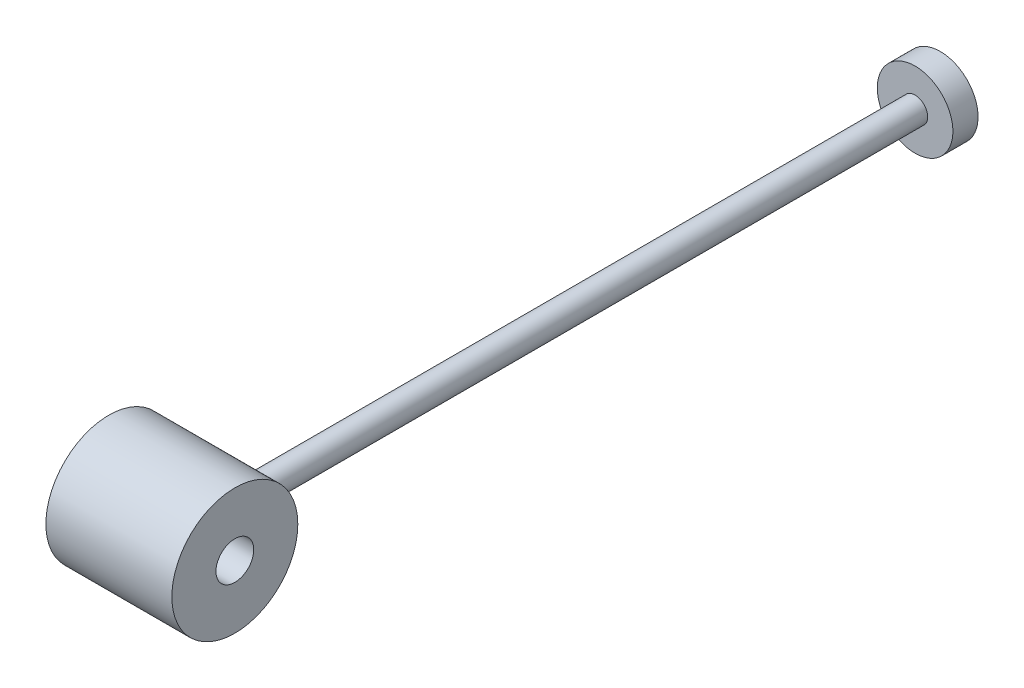
ISO-10303-21;
HEADER;
FILE_DESCRIPTION(('STEP AP214'),'2;1');
FILE_NAME('part.step','',(''),(''),'','','');
FILE_SCHEMA(('AUTOMOTIVE_DESIGN { 1 0 10303 214 1 1 1 1 }'));
ENDSEC;
DATA;
#1=APPLICATION_CONTEXT('core data for automotive mechanical design processes');
#2=APPLICATION_PROTOCOL_DEFINITION('international standard','automotive_design',2000,#1);
#3=PRODUCT_CONTEXT('',#1,'mechanical');
#4=PRODUCT('Part','Part','',(#3));
#5=PRODUCT_RELATED_PRODUCT_CATEGORY('part','',(#4));
#6=PRODUCT_DEFINITION_FORMATION('','',#4);
#7=PRODUCT_DEFINITION_CONTEXT('part definition',#1,'design');
#8=PRODUCT_DEFINITION('design','',#6,#7);
#9=PRODUCT_DEFINITION_SHAPE('','',#8);
#10=(LENGTH_UNIT() NAMED_UNIT(*) SI_UNIT(.MILLI.,.METRE.));
#11=(NAMED_UNIT(*) PLANE_ANGLE_UNIT() SI_UNIT($,.RADIAN.));
#12=(NAMED_UNIT(*) SI_UNIT($,.STERADIAN.) SOLID_ANGLE_UNIT());
#13=UNCERTAINTY_MEASURE_WITH_UNIT(LENGTH_MEASURE(1.E-05),#10,'distance_accuracy_value','');
#14=(GEOMETRIC_REPRESENTATION_CONTEXT(3) GLOBAL_UNCERTAINTY_ASSIGNED_CONTEXT((#13)) GLOBAL_UNIT_ASSIGNED_CONTEXT((#10,
#11,#12)) REPRESENTATION_CONTEXT('',''));
#15=CARTESIAN_POINT('',(0.,0.,0.));
#16=DIRECTION('',(0.,0.,1.));
#17=DIRECTION('',(1.,0.,0.));
#18=AXIS2_PLACEMENT_3D('',#15,#16,#17);
#19=CARTESIAN_POINT('',(0.,0.,-300.));
#20=DIRECTION('',(0.,0.,1.));
#21=DIRECTION('',(1.,0.,0.));
#22=AXIS2_PLACEMENT_3D('',#19,#20,#21);
#23=CYLINDRICAL_SURFACE('',#22,5.);
#24=CARTESIAN_POINT('',(5.,0.,-25.));
#25=CARTESIAN_POINT('',(5.00000276944634,0.138987493787324,-25.0000014065203));
#26=CARTESIAN_POINT('',(4.99420324928108,0.277940302046087,-24.9988389427216));
#27=CARTESIAN_POINT('',(4.97105635129736,0.554886864496204,-24.994224565157));
#28=CARTESIAN_POINT('',(4.95370679489748,0.692880432791918,-24.9907722194715));
#29=CARTESIAN_POINT('',(4.90758143771224,0.966937148503879,-24.981670242636));
#30=CARTESIAN_POINT('',(4.87879984551409,1.10299928122357,-24.9760194978176));
#31=CARTESIAN_POINT('',(4.81002534910899,1.37221108352448,-24.9626762565998));
#32=CARTESIAN_POINT('',(4.7700283237777,1.50535966309261,-24.9549830097359));
#33=CARTESIAN_POINT('',(4.67919625225816,1.76758319373794,-24.9377804442932));
#34=CARTESIAN_POINT('',(4.6283758297848,1.896663374225,-24.9282735779222));
#35=CARTESIAN_POINT('',(4.51622401781226,2.15009997814348,-24.9076944208426));
#36=CARTESIAN_POINT('',(4.45488875234116,2.2744546389337,-24.8966215531404));
#37=CARTESIAN_POINT('',(4.32219456929056,2.51749782000809,-24.8732206370355));
#38=CARTESIAN_POINT('',(4.25084014170608,2.63618884664851,-24.8608931515555));
#39=CARTESIAN_POINT('',(4.09856036475226,2.86722020463685,-24.8353088041128));
#40=CARTESIAN_POINT('',(4.01763144246466,2.97955814193968,-24.8220515959613));
#41=CARTESIAN_POINT('',(3.84577119317021,3.1983785388143,-24.7948114657324));
#42=CARTESIAN_POINT('',(3.75473335664577,3.30477652475172,-24.780821838943));
#43=CARTESIAN_POINT('',(3.56403766796452,3.50958996762925,-24.7526457290753));
#44=CARTESIAN_POINT('',(3.46437663408191,3.60800245195942,-24.738459174971));
#45=CARTESIAN_POINT('',(3.25716556407394,3.79610927604841,-24.7102933832022));
#46=CARTESIAN_POINT('',(3.1496178112366,3.88580612172819,-24.6963140869323));
#47=CARTESIAN_POINT('',(2.92729283454244,4.05592901668139,-24.6689453876667));
#48=CARTESIAN_POINT('',(2.81251295883554,4.13635163435981,-24.6555562041458));
#49=CARTESIAN_POINT('',(2.57548415685045,4.28798741229219,-24.6296394657581));
#50=CARTESIAN_POINT('',(2.4531786550123,4.35911381454494,-24.6171204770982));
#51=CARTESIAN_POINT('',(2.20287125287649,4.49081269831453,-24.5934353082732));
#52=CARTESIAN_POINT('',(2.07486723801243,4.55138122040544,-24.5822696361062));
#53=CARTESIAN_POINT('',(1.6837416438572,4.71644727257975,-24.5513304070068));
#54=CARTESIAN_POINT('',(1.41321932460559,4.80448882604819,-24.5340820165953));
#55=CARTESIAN_POINT('',(0.864538565206144,4.9326478026569,-24.508635793463));
#56=CARTESIAN_POINT('',(0.586526670293086,4.97337819482264,-24.5003223072134));
#57=CARTESIAN_POINT('',(0.027461501123977,5.00775493418216,-24.4933199482487));
#58=CARTESIAN_POINT('',(-0.253591459209596,5.00140609582257,-24.4946300913956));
#59=CARTESIAN_POINT('',(-0.806236719928547,4.94227436036826,-24.5066272442008));
#60=CARTESIAN_POINT('',(-1.07790777317425,4.89019310186595,-24.5171725589932));
#61=CARTESIAN_POINT('',(-1.60857963824175,4.7421890224497,-24.546227391949));
#62=CARTESIAN_POINT('',(-1.86757984431989,4.64626410780486,-24.5647372904544));
#63=CARTESIAN_POINT('',(-2.36757651014679,4.41262402680007,-24.6077809023025));
#64=CARTESIAN_POINT('',(-2.60843945190753,4.27463078523214,-24.632354484594));
#65=CARTESIAN_POINT('',(-3.06385419579619,3.96096784378848,-24.684730944745));
#66=CARTESIAN_POINT('',(-3.27840296964697,3.78529381392922,-24.7125341935642));
#67=CARTESIAN_POINT('',(-3.6791470271563,3.39749968079915,-24.7688510603976));
#68=CARTESIAN_POINT('',(-3.86476284328655,3.18478080820446,-24.797368460096));
#69=CARTESIAN_POINT('',(-4.19776922751518,2.73092511816778,-24.8514424361697));
#70=CARTESIAN_POINT('',(-4.34515930537601,2.48978793632426,-24.8769989745701));
#71=CARTESIAN_POINT('',(-4.59763754722347,1.98529693496818,-24.9223345079227));
#72=CARTESIAN_POINT('',(-4.70265946859707,1.72190909807364,-24.9421044423773));
#73=CARTESIAN_POINT('',(-4.86680236981849,1.18074488209619,-24.9735704494292));
#74=CARTESIAN_POINT('',(-4.92592890996419,0.902970250347196,-24.98526750005));
#75=CARTESIAN_POINT('',(-4.99578226936857,0.345897028150547,-24.9991335933204));
#76=CARTESIAN_POINT('',(-5.00730209891489,0.0667016415443211,-25.0014587325673));
#77=CARTESIAN_POINT('',(-4.98375070407561,-0.489624670880018,-24.9967525965614));
#78=CARTESIAN_POINT('',(-4.94868209878036,-0.766755711869968,-24.9897218472742));
#79=CARTESIAN_POINT('',(-4.8336081366968,-1.30852830007857,-24.9671916002008));
#80=CARTESIAN_POINT('',(-4.75400967390563,-1.57325974299468,-24.9517688194687));
#81=CARTESIAN_POINT('',(-4.55258007032458,-2.08561813620307,-24.9141776037933));
#82=CARTESIAN_POINT('',(-4.43074576544514,-2.33324380335236,-24.892008663478));
#83=CARTESIAN_POINT('',(-4.14658760866303,-2.80770587332562,-24.8429955738642));
#84=CARTESIAN_POINT('',(-3.98378632719944,-3.03425065213174,-24.8160975113418));
#85=CARTESIAN_POINT('',(-3.6229538115445,-3.45709007722326,-24.760736752006));
#86=CARTESIAN_POINT('',(-3.42491880020732,-3.65338147605436,-24.7322738876682));
#87=CARTESIAN_POINT('',(-2.9956341215523,-4.01320302351496,-24.6764651380018));
#88=CARTESIAN_POINT('',(-2.76392459020512,-4.17618877400404,-24.6491428619003));
#89=CARTESIAN_POINT('',(-2.2759398820373,-4.46092683850573,-24.5992097395686));
#90=CARTESIAN_POINT('',(-2.01966568861743,-4.58268080227279,-24.5765987048474));
#91=CARTESIAN_POINT('',(-1.49117106774616,-4.78076018011429,-24.5388364729789));
#92=CARTESIAN_POINT('',(-1.21904158214294,-4.85732111853824,-24.5236466726876));
#93=CARTESIAN_POINT('',(-0.665286950415525,-4.96353963899985,-24.5023739077135));
#94=CARTESIAN_POINT('',(-0.383663047477869,-4.99320333752649,-24.4962897554484));
#95=CARTESIAN_POINT('',(0.0366703889550776,-5.00179339144585,-24.4945288792509));
#96=CARTESIAN_POINT('',(0.175226568149243,-4.99885021968411,-24.4951330184965));
#97=CARTESIAN_POINT('',(0.451573795714482,-4.98148651470878,-24.4986714739674));
#98=CARTESIAN_POINT('',(0.589365114475224,-4.9670703371849,-24.5016049058833));
#99=CARTESIAN_POINT('',(0.863249015919121,-4.92686276339316,-24.5097212135577));
#100=CARTESIAN_POINT('',(0.99934098696874,-4.90106738632089,-24.5149048765081));
#101=CARTESIAN_POINT('',(1.26877990573972,-4.83831799577184,-24.5273664043086));
#102=CARTESIAN_POINT('',(1.40212781468395,-4.80136796328246,-24.5346435219816));
#103=CARTESIAN_POINT('',(1.66492270056654,-4.71667811844351,-24.5510651803018));
#104=CARTESIAN_POINT('',(1.79437724530106,-4.66896100938054,-24.5602057877658));
#105=CARTESIAN_POINT('',(2.0487516964052,-4.56306801677477,-24.5800998692381));
#106=CARTESIAN_POINT('',(2.17367318845506,-4.5048958336854,-24.5908527723703));
#107=CARTESIAN_POINT('',(2.41824756272708,-4.37847423732261,-24.6136768592635));
#108=CARTESIAN_POINT('',(2.53789823177196,-4.31022064232976,-24.6257485895239));
#109=CARTESIAN_POINT('',(2.77104924549456,-4.1641570153785,-24.6508678052533));
#110=CARTESIAN_POINT('',(2.88455168170255,-4.08635026305033,-24.6639149552593));
#111=CARTESIAN_POINT('',(3.10662673529869,-3.92025868558202,-24.6908640955351));
#112=CARTESIAN_POINT('',(3.21507953970716,-3.83181538764856,-24.7047769949563));
#113=CARTESIAN_POINT('',(3.42413829635704,-3.64620484015059,-24.7328525343466));
#114=CARTESIAN_POINT('',(3.52474699165411,-3.54904066604526,-24.7470150848702));
#115=CARTESIAN_POINT('',(3.71754062080305,-3.34655721556742,-24.7752095204235));
#116=CARTESIAN_POINT('',(3.80972053177606,-3.24123314471885,-24.7892413231228));
#117=CARTESIAN_POINT('',(3.98492694002668,-3.02322778921367,-24.8167717117019));
#118=CARTESIAN_POINT('',(4.06795679324696,-2.91054922625043,-24.8302704919035));
#119=CARTESIAN_POINT('',(4.22517389711511,-2.67729343786964,-24.8565085935593));
#120=CARTESIAN_POINT('',(4.29925523105979,-2.55664367436166,-24.869238066002));
#121=CARTESIAN_POINT('',(4.43694433521666,-2.30944481023433,-24.8934104051449));
#122=CARTESIAN_POINT('',(4.50055595131359,-2.18289789785572,-24.9048537437938));
#123=CARTESIAN_POINT('',(4.61682450350034,-1.9248233263731,-24.9261268452452));
#124=CARTESIAN_POINT('',(4.66948807030048,-1.79329873940674,-24.9359575839567));
#125=CARTESIAN_POINT('',(4.763487680713,-1.5261844247676,-24.9537310452209));
#126=CARTESIAN_POINT('',(4.8048259066209,-1.39059548585458,-24.9616741314688));
#127=CARTESIAN_POINT('',(4.89322312719739,-1.04920215690347,-24.9788087281562));
#128=CARTESIAN_POINT('',(4.93320981071553,-0.841457494405878,-24.9867141903289));
#129=CARTESIAN_POINT('',(4.98659571941881,-0.42244845328069,-24.9973086745575));
#130=CARTESIAN_POINT('',(4.99999579197194,-0.211184187046264,-24.9999978628663));
#131=CARTESIAN_POINT('',(5.,0.,-25.));
#132=B_SPLINE_CURVE_WITH_KNOTS('',3,(#24,#25,#26,#27,#28,#29,#30,#31,#32,#33,#34,#35,#36,#37,
#38,#39,#40,#41,#42,#43,#44,#45,#46,#47,#48,#49,#50,#51,#52,#53,#54,#55,#56,#57,#58,#59,#60,#61,
#62,#63,#64,#65,#66,#67,#68,#69,#70,#71,#72,#73,#74,#75,#76,#77,#78,#79,#80,#81,#82,#83,#84,#85,
#86,#87,#88,#89,#90,#91,#92,#93,#94,#95,#96,#97,#98,#99,#100,#101,#102,#103,#104,#105,#106,#107,
#108,#109,#110,#111,#112,#113,#114,#115,#116,#117,#118,#119,#120,#121,#122,#123,#124,#125,#126,
#127,#128,#129,#130,#131),.UNSPECIFIED.,.T.,.F.,(4,2,2,2,2,2,2,2,2,2,2,2,2,2,2,2,2,2,2,2,2,2,2,
2,2,2,2,2,2,2,2,2,2,2,2,2,2,2,2,2,2,2,2,2,2,2,2,2,2,2,2,2,2,4),(0.,0.416777047445417,
0.833632730149862,1.25069985977206,1.66792044248879,2.08458084615619,2.50139517036217,
2.91802329572164,3.33480738770838,3.75649664408719,4.17834216132243,4.60006602836891,
5.02194544187044,5.44751701120412,5.87324783701269,6.72369555497643,7.56299734191929,
8.40221330082507,9.22877443707772,10.0553750494503,10.8875625969434,11.7198458242473,
12.5671007113313,13.4143664637548,14.262951829465,15.1114343716656,15.9457248705771,
16.7799684696572,17.6067107843,18.4335150475649,19.2704413884317,20.1074575040603,
20.9572195157251,21.8069475229371,22.6522071384191,23.4973565033242,23.9127168808878,
24.3279196434016,24.7432677723233,25.1584678424529,25.5728004765726,25.9869867501795,
26.4013453111814,26.8155620171985,27.2369706991647,27.6582313488923,28.0797414220244,
28.5010963808509,28.9270309561325,29.3528087202144,29.7783278548953,30.203764937947,
30.8370559265658,31.4703267306209),.UNSPECIFIED.);
#133=CARTESIAN_POINT('',(5.,0.,-25.));
#134=VERTEX_POINT('',#133);
#135=EDGE_CURVE('E9',#134,#134,#132,.T.);
#136=ORIENTED_EDGE('',*,*,#135,.F.);
#137=EDGE_LOOP('',(#136));
#138=FACE_BOUND('',#137,.T.);
#139=CARTESIAN_POINT('',(0.,0.,-290.));
#140=DIRECTION('',(0.,0.,-1.));
#141=DIRECTION('',(-1.,0.,0.));
#142=AXIS2_PLACEMENT_3D('',#139,#140,#141);
#143=CIRCLE('',#142,5.);
#144=CARTESIAN_POINT('',(-5.,0.,-290.));
#145=VERTEX_POINT('',#144);
#146=EDGE_CURVE('E20',#145,#145,#143,.F.);
#147=ORIENTED_EDGE('',*,*,#146,.T.);
#148=EDGE_LOOP('',(#147));
#149=FACE_BOUND('',#148,.T.);
#150=ADVANCED_FACE('F16',(#138,#149),#23,.T.);
#151=CARTESIAN_POINT('',(-30.,0.,0.));
#152=DIRECTION('',(1.,0.,0.));
#153=DIRECTION('',(0.,0.,-1.));
#154=AXIS2_PLACEMENT_3D('',#151,#152,#153);
#155=CYLINDRICAL_SURFACE('',#154,25.);
#156=ORIENTED_EDGE('',*,*,#135,.T.);
#157=EDGE_LOOP('',(#156));
#158=FACE_BOUND('',#157,.T.);
#159=CARTESIAN_POINT('',(-30.,0.,0.));
#160=DIRECTION('',(1.,0.,0.));
#161=DIRECTION('',(0.,0.,-1.));
#162=AXIS2_PLACEMENT_3D('',#159,#160,#161);
#163=CIRCLE('',#162,25.);
#164=CARTESIAN_POINT('',(-30.,0.,-25.));
#165=VERTEX_POINT('',#164);
#166=EDGE_CURVE('E24',#165,#165,#163,.T.);
#167=ORIENTED_EDGE('',*,*,#166,.T.);
#168=EDGE_LOOP('',(#167));
#169=FACE_BOUND('',#168,.T.);
#170=CARTESIAN_POINT('',(20.,0.,0.));
#171=DIRECTION('',(1.,0.,0.));
#172=DIRECTION('',(0.,0.,-1.));
#173=AXIS2_PLACEMENT_3D('',#170,#171,#172);
#174=CIRCLE('',#173,25.);
#175=CARTESIAN_POINT('',(20.,0.,-25.));
#176=VERTEX_POINT('',#175);
#177=EDGE_CURVE('E28',#176,#176,#174,.T.);
#178=ORIENTED_EDGE('',*,*,#177,.F.);
#179=EDGE_LOOP('',(#178));
#180=FACE_BOUND('',#179,.T.);
#181=ADVANCED_FACE('F35',(#158,#169,#180),#155,.T.);
#182=CARTESIAN_POINT('',(-30.,0.,0.));
#183=DIRECTION('',(1.,0.,0.));
#184=DIRECTION('',(0.,0.,-1.));
#185=AXIS2_PLACEMENT_3D('',#182,#183,#184);
#186=PLANE('',#185);
#187=CARTESIAN_POINT('',(-30.,0.,0.));
#188=DIRECTION('',(1.,0.,0.));
#189=DIRECTION('',(0.,0.,-1.));
#190=AXIS2_PLACEMENT_3D('',#187,#188,#189);
#191=CIRCLE('',#190,7.5);
#192=CARTESIAN_POINT('',(-30.,0.,-7.5));
#193=VERTEX_POINT('',#192);
#194=EDGE_CURVE('E65',#193,#193,#191,.T.);
#195=ORIENTED_EDGE('',*,*,#194,.T.);
#196=EDGE_LOOP('',(#195));
#197=FACE_BOUND('',#196,.T.);
#198=ORIENTED_EDGE('',*,*,#166,.F.);
#199=EDGE_LOOP('',(#198));
#200=FACE_BOUND('',#199,.T.);
#201=ADVANCED_FACE('F39',(#197,#200),#186,.F.);
#202=CARTESIAN_POINT('',(20.,0.,0.));
#203=DIRECTION('',(1.,0.,0.));
#204=DIRECTION('',(0.,0.,-1.));
#205=AXIS2_PLACEMENT_3D('',#202,#203,#204);
#206=PLANE('',#205);
#207=CARTESIAN_POINT('',(20.,0.,0.));
#208=DIRECTION('',(1.,0.,0.));
#209=DIRECTION('',(0.,0.,-1.));
#210=AXIS2_PLACEMENT_3D('',#207,#208,#209);
#211=CIRCLE('',#210,7.5);
#212=CARTESIAN_POINT('',(20.,0.,-7.5));
#213=VERTEX_POINT('',#212);
#214=EDGE_CURVE('E62',#213,#213,#211,.T.);
#215=ORIENTED_EDGE('',*,*,#214,.F.);
#216=EDGE_LOOP('',(#215));
#217=FACE_BOUND('',#216,.T.);
#218=ORIENTED_EDGE('',*,*,#177,.T.);
#219=EDGE_LOOP('',(#218));
#220=FACE_BOUND('',#219,.T.);
#221=ADVANCED_FACE('F78',(#217,#220),#206,.T.);
#222=CARTESIAN_POINT('',(-30.,0.,0.));
#223=DIRECTION('',(1.,0.,0.));
#224=DIRECTION('',(0.,0.,-1.));
#225=AXIS2_PLACEMENT_3D('',#222,#223,#224);
#226=CYLINDRICAL_SURFACE('',#225,7.5);
#227=ORIENTED_EDGE('',*,*,#194,.F.);
#228=EDGE_LOOP('',(#227));
#229=FACE_BOUND('',#228,.T.);
#230=ORIENTED_EDGE('',*,*,#214,.T.);
#231=EDGE_LOOP('',(#230));
#232=FACE_BOUND('',#231,.T.);
#233=ADVANCED_FACE('F81',(#229,#232),#226,.F.);
#234=CARTESIAN_POINT('',(0.,0.,-290.));
#235=DIRECTION('',(0.,0.,-1.));
#236=DIRECTION('',(-1.,0.,0.));
#237=AXIS2_PLACEMENT_3D('',#234,#235,#236);
#238=CYLINDRICAL_SURFACE('',#237,15.);
#239=CARTESIAN_POINT('',(0.,0.,-290.));
#240=DIRECTION('',(0.,0.,-1.));
#241=DIRECTION('',(-1.,0.,0.));
#242=AXIS2_PLACEMENT_3D('',#239,#240,#241);
#243=CIRCLE('',#242,15.);
#244=CARTESIAN_POINT('',(-15.,0.,-290.));
#245=VERTEX_POINT('',#244);
#246=EDGE_CURVE('E63',#245,#245,#243,.T.);
#247=ORIENTED_EDGE('',*,*,#246,.T.);
#248=EDGE_LOOP('',(#247));
#249=FACE_BOUND('',#248,.T.);
#250=CARTESIAN_POINT('',(0.,0.,-300.));
#251=DIRECTION('',(0.,0.,-1.));
#252=DIRECTION('',(-1.,0.,0.));
#253=AXIS2_PLACEMENT_3D('',#250,#251,#252);
#254=CIRCLE('',#253,15.);
#255=CARTESIAN_POINT('',(-15.,0.,-300.));
#256=VERTEX_POINT('',#255);
#257=EDGE_CURVE('E68',#256,#256,#254,.T.);
#258=ORIENTED_EDGE('',*,*,#257,.F.);
#259=EDGE_LOOP('',(#258));
#260=FACE_BOUND('',#259,.T.);
#261=ADVANCED_FACE('F50',(#249,#260),#238,.T.);
#262=CARTESIAN_POINT('',(0.,0.,-290.));
#263=DIRECTION('',(0.,0.,-1.));
#264=DIRECTION('',(-1.,0.,0.));
#265=AXIS2_PLACEMENT_3D('',#262,#263,#264);
#266=PLANE('',#265);
#267=ORIENTED_EDGE('',*,*,#146,.F.);
#268=EDGE_LOOP('',(#267));
#269=FACE_BOUND('',#268,.T.);
#270=ORIENTED_EDGE('',*,*,#246,.F.);
#271=EDGE_LOOP('',(#270));
#272=FACE_BOUND('',#271,.T.);
#273=ADVANCED_FACE('F43',(#269,#272),#266,.F.);
#274=CARTESIAN_POINT('',(0.,0.,-300.));
#275=DIRECTION('',(0.,0.,1.));
#276=DIRECTION('',(1.,0.,0.));
#277=AXIS2_PLACEMENT_3D('',#274,#275,#276);
#278=PLANE('',#277);
#279=ORIENTED_EDGE('',*,*,#257,.T.);
#280=EDGE_LOOP('',(#279));
#281=FACE_BOUND('',#280,.T.);
#282=ADVANCED_FACE('F41',(#281),#278,.F.);
#283=CLOSED_SHELL('',(#150,#181,#201,#221,#233,#261,#273,#282));
#284=MANIFOLD_SOLID_BREP('B1',#283);
#285=ADVANCED_BREP_SHAPE_REPRESENTATION('',(#18,#284),#14);
#286=SHAPE_DEFINITION_REPRESENTATION(#9,#285);
ENDSEC;
END-ISO-10303-21;
